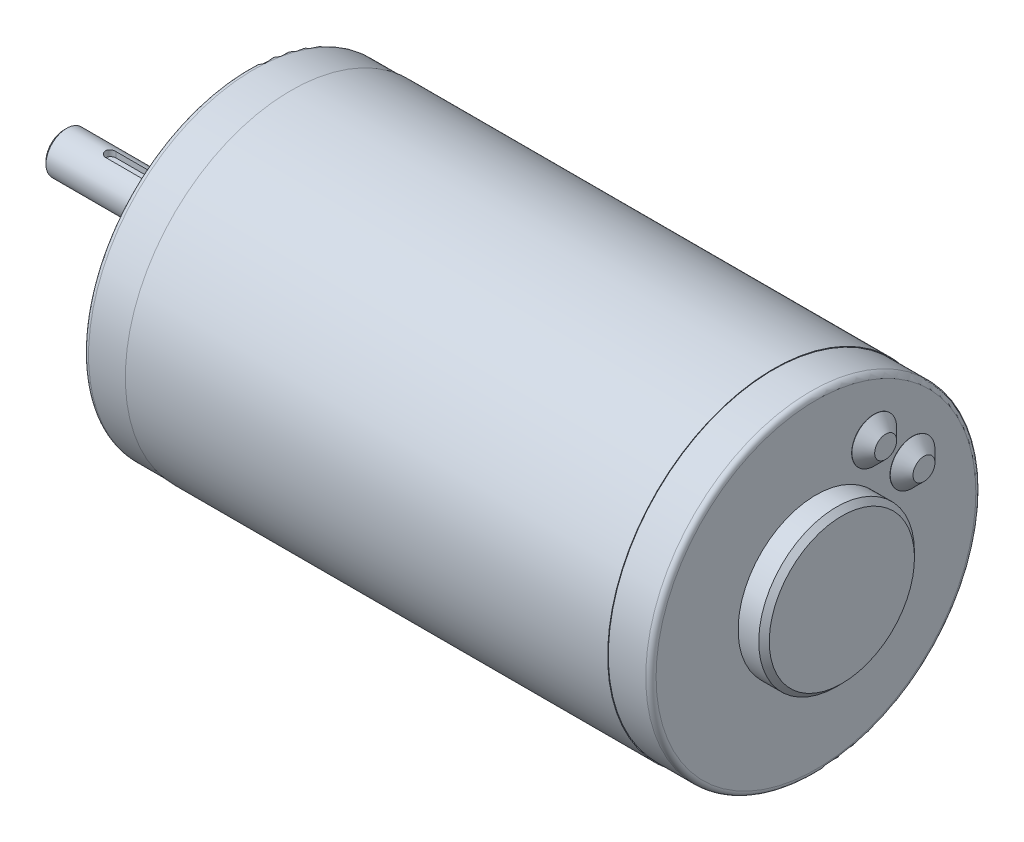
ISO-10303-21;
HEADER;
FILE_DESCRIPTION(('STEP AP214'),'2;1');
FILE_NAME('part.step','',(''),(''),'','','');
FILE_SCHEMA(('AUTOMOTIVE_DESIGN { 1 0 10303 214 1 1 1 1 }'));
ENDSEC;
DATA;
#1=APPLICATION_CONTEXT('core data for automotive mechanical design processes');
#2=APPLICATION_PROTOCOL_DEFINITION('international standard','automotive_design',2000,#1);
#3=PRODUCT_CONTEXT('',#1,'mechanical');
#4=PRODUCT('Part','Part','',(#3));
#5=PRODUCT_RELATED_PRODUCT_CATEGORY('part','',(#4));
#6=PRODUCT_DEFINITION_FORMATION('','',#4);
#7=PRODUCT_DEFINITION_CONTEXT('part definition',#1,'design');
#8=PRODUCT_DEFINITION('design','',#6,#7);
#9=PRODUCT_DEFINITION_SHAPE('','',#8);
#10=(LENGTH_UNIT() NAMED_UNIT(*) SI_UNIT(.MILLI.,.METRE.));
#11=(NAMED_UNIT(*) PLANE_ANGLE_UNIT() SI_UNIT($,.RADIAN.));
#12=(NAMED_UNIT(*) SI_UNIT($,.STERADIAN.) SOLID_ANGLE_UNIT());
#13=UNCERTAINTY_MEASURE_WITH_UNIT(LENGTH_MEASURE(1.E-05),#10,'distance_accuracy_value','');
#14=(GEOMETRIC_REPRESENTATION_CONTEXT(3) GLOBAL_UNCERTAINTY_ASSIGNED_CONTEXT((#13)) GLOBAL_UNIT_ASSIGNED_CONTEXT((#10,
#11,#12)) REPRESENTATION_CONTEXT('',''));
#15=CARTESIAN_POINT('',(0.,0.,0.));
#16=DIRECTION('',(0.,0.,1.));
#17=DIRECTION('',(1.,0.,0.));
#18=AXIS2_PLACEMENT_3D('',#15,#16,#17);
#19=CARTESIAN_POINT('',(-27.6,2.79999999999999,-1.));
#20=DIRECTION('',(0.,-1.,0.));
#21=DIRECTION('',(0.,0.,-1.));
#22=AXIS2_PLACEMENT_3D('',#19,#20,#21);
#23=PLANE('',#22);
#24=CARTESIAN_POINT('',(-7.1,2.79999999999999,0.));
#25=DIRECTION('',(0.,1.,0.));
#26=DIRECTION('',(0.,0.,1.));
#27=AXIS2_PLACEMENT_3D('',#24,#25,#26);
#28=CIRCLE('',#27,1.);
#29=CARTESIAN_POINT('',(-7.1,2.79999999999999,1.));
#30=VERTEX_POINT('',#29);
#31=CARTESIAN_POINT('',(-7.1,2.79999999999999,-1.));
#32=VERTEX_POINT('',#31);
#33=EDGE_CURVE('E79',#30,#32,#28,.T.);
#34=ORIENTED_EDGE('',*,*,#33,.T.);
#35=DIRECTION('',(1.,0.,0.));
#36=VECTOR('',#35,1.);
#37=CARTESIAN_POINT('',(-27.6,2.79999999999999,-1.));
#38=LINE('',#37,#36);
#39=CARTESIAN_POINT('',(-26.6,2.79999999999999,-1.));
#40=VERTEX_POINT('',#39);
#41=EDGE_CURVE('E74',#40,#32,#38,.T.);
#42=ORIENTED_EDGE('',*,*,#41,.F.);
#43=CARTESIAN_POINT('',(-26.6,2.79999999999999,0.));
#44=DIRECTION('',(0.,-1.,0.));
#45=DIRECTION('',(0.,0.,-1.));
#46=AXIS2_PLACEMENT_3D('',#43,#44,#45);
#47=CIRCLE('',#46,1.);
#48=CARTESIAN_POINT('',(-26.6,2.79999999999999,1.));
#49=VERTEX_POINT('',#48);
#50=EDGE_CURVE('E76',#40,#49,#47,.F.);
#51=ORIENTED_EDGE('',*,*,#50,.T.);
#52=DIRECTION('',(1.,0.,0.));
#53=VECTOR('',#52,1.);
#54=CARTESIAN_POINT('',(-27.6,2.79999999999999,1.));
#55=LINE('',#54,#53);
#56=EDGE_CURVE('E102',#49,#30,#55,.T.);
#57=ORIENTED_EDGE('',*,*,#56,.T.);
#58=EDGE_LOOP('',(#34,#42,#51,#57));
#59=FACE_BOUND('',#58,.T.);
#60=ADVANCED_FACE('F16',(#59),#23,.F.);
#61=CARTESIAN_POINT('',(-35.6,0.,0.));
#62=DIRECTION('',(-1.,0.,0.));
#63=DIRECTION('',(0.,0.,1.));
#64=AXIS2_PLACEMENT_3D('',#61,#62,#63);
#65=PLANE('',#64);
#66=CARTESIAN_POINT('',(-35.6000000000449,0.,0.));
#67=DIRECTION('',(1.,0.,0.));
#68=DIRECTION('',(0.,0.,-1.));
#69=AXIS2_PLACEMENT_3D('',#66,#67,#68);
#70=CIRCLE('',#69,3.49999999997408);
#71=CARTESIAN_POINT('',(-35.6000000000449,0.,-3.49999999997408));
#72=VERTEX_POINT('',#71);
#73=EDGE_CURVE('E324',#72,#72,#70,.T.);
#74=ORIENTED_EDGE('',*,*,#73,.F.);
#75=EDGE_LOOP('',(#74));
#76=FACE_BOUND('',#75,.T.);
#77=ADVANCED_FACE('F667',(#76),#65,.T.);
#78=CARTESIAN_POINT('',(-26.6,3.87298334620741,0.));
#79=DIRECTION('',(0.,-1.,0.));
#80=DIRECTION('',(0.,0.,-1.));
#81=AXIS2_PLACEMENT_3D('',#78,#79,#80);
#82=CYLINDRICAL_SURFACE('',#81,1.);
#83=CARTESIAN_POINT('',(-26.6,3.87298334620741,1.));
#84=CARTESIAN_POINT('',(-26.6276629851065,3.87298148580177,1.00000033749611));
#85=CARTESIAN_POINT('',(-26.6553122630182,3.8732800994947,0.998851407375366));
#86=CARTESIAN_POINT('',(-26.7104040353036,3.87445904774558,0.994271295395754));
#87=CARTESIAN_POINT('',(-26.7378465636871,3.87533928441687,0.99084049757268));
#88=CARTESIAN_POINT('',(-26.8194531732088,3.87881710972053,0.977175239382527));
#89=CARTESIAN_POINT('',(-26.8730564684822,3.88225203148808,0.963567695172493));
#90=CARTESIAN_POINT('',(-26.977124673782,3.89095422588002,0.927798076247996));
#91=CARTESIAN_POINT('',(-27.0275898782129,3.89622132630929,0.905636805423835));
#92=CARTESIAN_POINT('',(-27.1241114486473,3.90799134471939,0.853415378025865));
#93=CARTESIAN_POINT('',(-27.170166627891,3.91449459395647,0.823353103356933));
#94=CARTESIAN_POINT('',(-27.2575438819061,3.92816262398025,0.755484471828068));
#95=CARTESIAN_POINT('',(-27.2987548862455,3.93533791028915,0.717537268783974));
#96=CARTESIAN_POINT('',(-27.3743020894827,3.94945104396193,0.635275780516228));
#97=CARTESIAN_POINT('',(-27.4086371894679,3.95638885322537,0.590960479478829));
#98=CARTESIAN_POINT('',(-27.4699110016186,3.96936182283248,0.496456899401689));
#99=CARTESIAN_POINT('',(-27.496739895984,3.9753830468173,0.446195340334472));
#100=CARTESIAN_POINT('',(-27.5415247341967,3.98572346250588,0.341702590842916));
#101=CARTESIAN_POINT('',(-27.5594824242998,3.990042989147,0.287472184083007));
#102=CARTESIAN_POINT('',(-27.5856589927774,3.99641900005128,0.177744108525158));
#103=CARTESIAN_POINT('',(-27.5940676724228,3.998519529013,0.122294322002856));
#104=CARTESIAN_POINT('',(-27.6015033715433,4.00037438150815,0.0107327756816783));
#105=CARTESIAN_POINT('',(-27.6005315701923,4.00012899993444,-0.0453789000287066));
#106=CARTESIAN_POINT('',(-27.5893700363145,3.99735237365735,-0.155352492972097));
#107=CARTESIAN_POINT('',(-27.5793853834005,3.9948719867736,-0.209236701739855));
#108=CARTESIAN_POINT('',(-27.5508113208172,3.98796330636495,-0.31453871108434));
#109=CARTESIAN_POINT('',(-27.5322215304314,3.98353492665556,-0.365956402423988));
#110=CARTESIAN_POINT('',(-27.4867987193293,3.97314997761798,-0.46540728602454));
#111=CARTESIAN_POINT('',(-27.4598926057672,3.96717993827555,-0.513405629602248));
#112=CARTESIAN_POINT('',(-27.3986568701665,3.95435945541919,-0.604276631230015));
#113=CARTESIAN_POINT('',(-27.3643261297468,3.94750887933198,-0.64714851556229));
#114=CARTESIAN_POINT('',(-27.2881210879187,3.93345566022865,-0.727769389708492));
#115=CARTESIAN_POINT('',(-27.2460683634602,3.92624850477685,-0.765349103054128));
#116=CARTESIAN_POINT('',(-27.1561701330723,3.91246168284006,-0.832969575186237));
#117=CARTESIAN_POINT('',(-27.1083230467164,3.90588218842993,-0.863008270245062));
#118=CARTESIAN_POINT('',(-27.0078544021762,3.89407813586325,-0.914804709285962));
#119=CARTESIAN_POINT('',(-26.9552085351039,3.88886106009136,-0.936517017887269));
#120=CARTESIAN_POINT('',(-26.8468830715817,3.88047058807055,-0.970702351849828));
#121=CARTESIAN_POINT('',(-26.7912081448502,3.87729413761435,-0.983189189212132));
#122=CARTESIAN_POINT('',(-26.7125426192411,3.87455290681524,-0.993904635150938));
#123=CARTESIAN_POINT('',(-26.6900802967868,3.87396523110859,-0.996190790966708));
#124=CARTESIAN_POINT('',(-26.6450822100907,3.87318062488974,-0.999236757697394));
#125=CARTESIAN_POINT('',(-26.6225466240447,3.87298306219461,-0.999999038096045));
#126=CARTESIAN_POINT('',(-26.6,3.87298334620741,-1.));
#127=B_SPLINE_CURVE_WITH_KNOTS('',3,(#83,#84,#85,#86,#87,#88,#89,#90,#91,#92,#93,#94,#95,#96,
#97,#98,#99,#100,#101,#102,#103,#104,#105,#106,#107,#108,#109,#110,#111,#112,#113,#114,#115,
#116,#117,#118,#119,#120,#121,#122,#123,#124,#125,#126),.UNSPECIFIED.,.F.,.F.,(4,2,2,2,2,2,2,2,
2,2,2,2,2,2,2,2,2,2,2,2,2,4),(0.,0.0829365303397693,0.16585910608465,0.331229963080318,
0.496585282091499,0.661984974726751,0.830641897427977,0.999325753539196,1.17036187098235,
1.34136430732425,1.50890481515325,1.67642426256639,1.84022545479276,2.00403389475838,
2.16932509450376,2.33464120964329,2.50441429534542,2.67423379180967,2.84496720161068,
3.01544447539986,3.08315848722648,3.15076267731671),.UNSPECIFIED.);
#128=CARTESIAN_POINT('',(-26.6,3.87298334620741,1.));
#129=VERTEX_POINT('',#128);
#130=CARTESIAN_POINT('',(-26.6,3.87298334620741,-1.));
#131=VERTEX_POINT('',#130);
#132=EDGE_CURVE('E160',#129,#131,#127,.T.);
#133=ORIENTED_EDGE('',*,*,#132,.F.);
#134=DIRECTION('',(0.,1.,0.));
#135=VECTOR('',#134,1.);
#136=CARTESIAN_POINT('',(-26.6,2.79999999999999,1.));
#137=LINE('',#136,#135);
#138=EDGE_CURVE('E89',#129,#49,#137,.F.);
#139=ORIENTED_EDGE('',*,*,#138,.T.);
#140=ORIENTED_EDGE('',*,*,#50,.F.);
#141=DIRECTION('',(0.,1.,0.));
#142=VECTOR('',#141,1.);
#143=CARTESIAN_POINT('',(-26.6,2.79999999999999,-1.));
#144=LINE('',#143,#142);
#145=EDGE_CURVE('E83',#131,#40,#144,.F.);
#146=ORIENTED_EDGE('',*,*,#145,.F.);
#147=EDGE_LOOP('',(#133,#139,#140,#146));
#148=FACE_BOUND('',#147,.T.);
#149=ADVANCED_FACE('F86',(#148),#82,.F.);
#150=CARTESIAN_POINT('',(-27.6,2.79999999999999,-1.));
#151=DIRECTION('',(0.,0.,1.));
#152=DIRECTION('',(1.,0.,0.));
#153=AXIS2_PLACEMENT_3D('',#150,#151,#152);
#154=PLANE('',#153);
#155=DIRECTION('',(1.,0.,0.));
#156=VECTOR('',#155,1.);
#157=CARTESIAN_POINT('',(0.,3.87298334620741,-1.));
#158=LINE('',#157,#156);
#159=CARTESIAN_POINT('',(-7.1,3.87298334620741,-1.));
#160=VERTEX_POINT('',#159);
#161=EDGE_CURVE('E94',#131,#160,#158,.T.);
#162=ORIENTED_EDGE('',*,*,#161,.F.);
#163=ORIENTED_EDGE('',*,*,#145,.T.);
#164=ORIENTED_EDGE('',*,*,#41,.T.);
#165=DIRECTION('',(0.,1.,0.));
#166=VECTOR('',#165,1.);
#167=CARTESIAN_POINT('',(-7.1,2.79999999999999,-1.));
#168=LINE('',#167,#166);
#169=EDGE_CURVE('E97',#32,#160,#168,.T.);
#170=ORIENTED_EDGE('',*,*,#169,.T.);
#171=EDGE_LOOP('',(#162,#163,#164,#170));
#172=FACE_BOUND('',#171,.T.);
#173=ADVANCED_FACE('F92',(#172),#154,.T.);
#174=CARTESIAN_POINT('',(-7.1,2.79999999999999,0.));
#175=DIRECTION('',(0.,1.,0.));
#176=DIRECTION('',(0.,0.,1.));
#177=AXIS2_PLACEMENT_3D('',#174,#175,#176);
#178=CYLINDRICAL_SURFACE('',#177,1.);
#179=ORIENTED_EDGE('',*,*,#33,.F.);
#180=DIRECTION('',(0.,1.,0.));
#181=VECTOR('',#180,1.);
#182=CARTESIAN_POINT('',(-7.1,2.79999999999999,1.));
#183=LINE('',#182,#181);
#184=CARTESIAN_POINT('',(-7.1,3.87298334620741,1.));
#185=VERTEX_POINT('',#184);
#186=EDGE_CURVE('E103',#30,#185,#183,.T.);
#187=ORIENTED_EDGE('',*,*,#186,.T.);
#188=CARTESIAN_POINT('',(-7.1,3.87298334620741,-1.));
#189=CARTESIAN_POINT('',(-7.07233701489346,3.87298148580177,-1.00000033749611));
#190=CARTESIAN_POINT('',(-7.04468773698177,3.8732800994947,-0.998851407375366));
#191=CARTESIAN_POINT('',(-6.98959596469644,3.87445904774558,-0.994271295395754));
#192=CARTESIAN_POINT('',(-6.96215343631291,3.87533928441687,-0.990840497572679));
#193=CARTESIAN_POINT('',(-6.88054682679116,3.87881710972053,-0.977175239382527));
#194=CARTESIAN_POINT('',(-6.82694353151779,3.88225203148808,-0.963567695172494));
#195=CARTESIAN_POINT('',(-6.72287532621804,3.89095422588002,-0.927798076247997));
#196=CARTESIAN_POINT('',(-6.67241012178715,3.89622132630929,-0.905636805423836));
#197=CARTESIAN_POINT('',(-6.57588855135267,3.90799134471939,-0.853415378025865));
#198=CARTESIAN_POINT('',(-6.52983337210904,3.91449459395647,-0.823353103356933));
#199=CARTESIAN_POINT('',(-6.4424561180939,3.92816262398025,-0.755484471828069));
#200=CARTESIAN_POINT('',(-6.40124511375448,3.93533791028915,-0.717537268783976));
#201=CARTESIAN_POINT('',(-6.3256979105173,3.94945104396193,-0.63527578051623));
#202=CARTESIAN_POINT('',(-6.29136281053206,3.95638885322537,-0.590960479478831));
#203=CARTESIAN_POINT('',(-6.23008899838136,3.96936182283248,-0.496456899401691));
#204=CARTESIAN_POINT('',(-6.20326010401603,3.9753830468173,-0.446195340334474));
#205=CARTESIAN_POINT('',(-6.1584752658033,3.98572346250588,-0.341702590842919));
#206=CARTESIAN_POINT('',(-6.14051757570017,3.990042989147,-0.28747218408301));
#207=CARTESIAN_POINT('',(-6.11434100722257,3.99641900005128,-0.17774410852516));
#208=CARTESIAN_POINT('',(-6.10593232757718,3.998519529013,-0.122294322002858));
#209=CARTESIAN_POINT('',(-6.09849662845671,4.00037438150815,-0.0107327756816796));
#210=CARTESIAN_POINT('',(-6.09946842980766,4.00012899993444,0.0453789000287056));
#211=CARTESIAN_POINT('',(-6.11062996368545,3.99735237365735,0.155352492972096));
#212=CARTESIAN_POINT('',(-6.12061461659948,3.9948719867736,0.209236701739855));
#213=CARTESIAN_POINT('',(-6.14918867918275,3.98796330636495,0.31453871108434));
#214=CARTESIAN_POINT('',(-6.16777846956858,3.98353492665556,0.365956402423988));
#215=CARTESIAN_POINT('',(-6.21320128067065,3.97314997761798,0.465407286024539));
#216=CARTESIAN_POINT('',(-6.24010739423284,3.96717993827555,0.513405629602249));
#217=CARTESIAN_POINT('',(-6.30134312983347,3.95435945541919,0.604276631230014));
#218=CARTESIAN_POINT('',(-6.33567387025322,3.94750887933198,0.647148515562289));
#219=CARTESIAN_POINT('',(-6.41187891208131,3.93345566022865,0.72776938970849));
#220=CARTESIAN_POINT('',(-6.45393163653982,3.92624850477685,0.765349103054127));
#221=CARTESIAN_POINT('',(-6.54382986692774,3.91246168284006,0.832969575186237));
#222=CARTESIAN_POINT('',(-6.59167695328356,3.90588218842993,0.863008270245062));
#223=CARTESIAN_POINT('',(-6.69214559782377,3.89407813586325,0.914804709285962));
#224=CARTESIAN_POINT('',(-6.74479146489609,3.88886106009136,0.936517017887269));
#225=CARTESIAN_POINT('',(-6.85311692841829,3.88047058807055,0.970702351849828));
#226=CARTESIAN_POINT('',(-6.90879185514984,3.87729413761435,0.983189189212131));
#227=CARTESIAN_POINT('',(-6.98745738075891,3.87455290681524,0.993904635150938));
#228=CARTESIAN_POINT('',(-7.00991970321318,3.87396523110859,0.996190790966708));
#229=CARTESIAN_POINT('',(-7.05491778990932,3.87318062488974,0.999236757697394));
#230=CARTESIAN_POINT('',(-7.07745337595529,3.8729830621946,0.999999038096045));
#231=CARTESIAN_POINT('',(-7.1,3.87298334620741,1.));
#232=B_SPLINE_CURVE_WITH_KNOTS('',3,(#188,#189,#190,#191,#192,#193,#194,#195,#196,#197,#198,
#199,#200,#201,#202,#203,#204,#205,#206,#207,#208,#209,#210,#211,#212,#213,#214,#215,#216,#217,
#218,#219,#220,#221,#222,#223,#224,#225,#226,#227,#228,#229,#230,#231),.UNSPECIFIED.,.F.,.F.,(4,
2,2,2,2,2,2,2,2,2,2,2,2,2,2,2,2,2,2,2,2,4),(0.,0.0829365303397684,0.165859106084651,
0.331229963080317,0.496585282091498,0.661984974726749,0.830641897427974,0.999325753539193,
1.17036187098235,1.34136430732424,1.50890481515325,1.67642426256639,1.84022545479276,
2.00403389475838,2.16932509450376,2.33464120964329,2.50441429534542,2.67423379180967,
2.84496720161068,3.01544447539986,3.08315848722648,3.15076267731671),.UNSPECIFIED.);
#233=EDGE_CURVE('E151',#160,#185,#232,.T.);
#234=ORIENTED_EDGE('',*,*,#233,.F.);
#235=ORIENTED_EDGE('',*,*,#169,.F.);
#236=EDGE_LOOP('',(#179,#187,#234,#235));
#237=FACE_BOUND('',#236,.T.);
#238=ADVANCED_FACE('F166',(#237),#178,.F.);
#239=CARTESIAN_POINT('',(-27.6,2.79999999999999,1.));
#240=DIRECTION('',(0.,0.,1.));
#241=DIRECTION('',(1.,0.,0.));
#242=AXIS2_PLACEMENT_3D('',#239,#240,#241);
#243=PLANE('',#242);
#244=ORIENTED_EDGE('',*,*,#186,.F.);
#245=ORIENTED_EDGE('',*,*,#56,.F.);
#246=ORIENTED_EDGE('',*,*,#138,.F.);
#247=DIRECTION('',(1.,0.,0.));
#248=VECTOR('',#247,1.);
#249=CARTESIAN_POINT('',(0.,3.87298334620741,1.));
#250=LINE('',#249,#248);
#251=EDGE_CURVE('E159',#185,#129,#250,.F.);
#252=ORIENTED_EDGE('',*,*,#251,.F.);
#253=EDGE_LOOP('',(#244,#245,#246,#252));
#254=FACE_BOUND('',#253,.T.);
#255=ADVANCED_FACE('F181',(#254),#243,.F.);
#256=CARTESIAN_POINT('',(-35.0999999999999,0.,0.));
#257=DIRECTION('',(1.,0.,0.));
#258=DIRECTION('',(0.,0.,-1.));
#259=AXIS2_PLACEMENT_3D('',#256,#257,#258);
#260=CONICAL_SURFACE('',#259,3.99999999996226,0.785398163340605);
#261=ORIENTED_EDGE('',*,*,#73,.T.);
#262=EDGE_LOOP('',(#261));
#263=FACE_BOUND('',#262,.T.);
#264=CARTESIAN_POINT('',(-35.1,0.,0.));
#265=DIRECTION('',(1.,0.,0.));
#266=DIRECTION('',(0.,0.,-1.));
#267=AXIS2_PLACEMENT_3D('',#264,#265,#266);
#268=CIRCLE('',#267,4.);
#269=CARTESIAN_POINT('',(-35.1,0.,-4.));
#270=VERTEX_POINT('',#269);
#271=EDGE_CURVE('E150',#270,#270,#268,.T.);
#272=ORIENTED_EDGE('',*,*,#271,.F.);
#273=EDGE_LOOP('',(#272));
#274=FACE_BOUND('',#273,.T.);
#275=ADVANCED_FACE('F176',(#263,#274),#260,.T.);
#276=CARTESIAN_POINT('',(0.,0.,0.));
#277=DIRECTION('',(1.,0.,0.));
#278=DIRECTION('',(0.,0.,-1.));
#279=AXIS2_PLACEMENT_3D('',#276,#277,#278);
#280=CYLINDRICAL_SURFACE('',#279,4.);
#281=ORIENTED_EDGE('',*,*,#271,.T.);
#282=EDGE_LOOP('',(#281));
#283=FACE_BOUND('',#282,.T.);
#284=CARTESIAN_POINT('',(-4.,0.,0.));
#285=DIRECTION('',(1.,0.,0.));
#286=DIRECTION('',(0.,0.,-1.));
#287=AXIS2_PLACEMENT_3D('',#284,#285,#286);
#288=CIRCLE('',#287,4.);
#289=CARTESIAN_POINT('',(-4.,0.,-4.));
#290=VERTEX_POINT('',#289);
#291=EDGE_CURVE('E147',#290,#290,#288,.T.);
#292=ORIENTED_EDGE('',*,*,#291,.F.);
#293=EDGE_LOOP('',(#292));
#294=FACE_BOUND('',#293,.T.);
#295=ORIENTED_EDGE('',*,*,#233,.T.);
#296=ORIENTED_EDGE('',*,*,#251,.T.);
#297=ORIENTED_EDGE('',*,*,#132,.T.);
#298=ORIENTED_EDGE('',*,*,#161,.T.);
#299=EDGE_LOOP('',(#295,#296,#297,#298));
#300=FACE_BOUND('',#299,.T.);
#301=ADVANCED_FACE('F170',(#283,#294,#300),#280,.T.);
#302=CARTESIAN_POINT('',(-4.,4.,0.));
#303=DIRECTION('',(-1.,0.,0.));
#304=DIRECTION('',(0.,0.,1.));
#305=AXIS2_PLACEMENT_3D('',#302,#303,#304);
#306=PLANE('',#305);
#307=ORIENTED_EDGE('',*,*,#291,.T.);
#308=EDGE_LOOP('',(#307));
#309=FACE_BOUND('',#308,.T.);
#310=CARTESIAN_POINT('',(-4.,0.,0.));
#311=DIRECTION('',(1.,0.,0.));
#312=DIRECTION('',(0.,1.,0.));
#313=AXIS2_PLACEMENT_3D('',#310,#311,#312);
#314=CIRCLE('',#313,8.509);
#315=CARTESIAN_POINT('',(-4.,8.509,0.));
#316=VERTEX_POINT('',#315);
#317=EDGE_CURVE('E144',#316,#316,#314,.T.);
#318=ORIENTED_EDGE('',*,*,#317,.F.);
#319=EDGE_LOOP('',(#318));
#320=FACE_BOUND('',#319,.T.);
#321=ADVANCED_FACE('F175',(#309,#320),#306,.T.);
#322=CARTESIAN_POINT('',(111.8479,18.6070906828553,-11.2073596390943));
#323=DIRECTION('',(1.,0.,0.));
#324=DIRECTION('',(0.,0.,-1.));
#325=AXIS2_PLACEMENT_3D('',#322,#323,#324);
#326=PLANE('',#325);
#327=CARTESIAN_POINT('',(111.84789999993,18.6070906828553,-11.2073596390943));
#328=DIRECTION('',(-1.,0.,0.));
#329=DIRECTION('',(0.,-1.,0.));
#330=AXIS2_PLACEMENT_3D('',#327,#328,#329);
#331=CIRCLE('',#330,2.11800000003146);
#332=CARTESIAN_POINT('',(111.84789999993,16.4890906828238,-11.2073596390943));
#333=VERTEX_POINT('',#332);
#334=EDGE_CURVE('E141',#333,#333,#331,.T.);
#335=ORIENTED_EDGE('',*,*,#334,.F.);
#336=EDGE_LOOP('',(#335));
#337=FACE_BOUND('',#336,.T.);
#338=ADVANCED_FACE('F484',(#337),#326,.T.);
#339=CARTESIAN_POINT('',(114.6,15.0368,0.));
#340=DIRECTION('',(1.,0.,0.));
#341=DIRECTION('',(0.,0.,-1.));
#342=AXIS2_PLACEMENT_3D('',#339,#340,#341);
#343=PLANE('',#342);
#344=CARTESIAN_POINT('',(114.6,0.,0.));
#345=DIRECTION('',(-1.,0.,0.));
#346=DIRECTION('',(0.,-1.,0.));
#347=AXIS2_PLACEMENT_3D('',#344,#345,#346);
#348=CIRCLE('',#347,14.0208);
#349=CARTESIAN_POINT('',(114.6,-14.0208,0.));
#350=VERTEX_POINT('',#349);
#351=EDGE_CURVE('E138',#350,#350,#348,.T.);
#352=ORIENTED_EDGE('',*,*,#351,.F.);
#353=EDGE_LOOP('',(#352));
#354=FACE_BOUND('',#353,.T.);
#355=ADVANCED_FACE('F474',(#354),#343,.T.);
#356=CARTESIAN_POINT('',(111.8479,11.2073596390943,-18.6070906828553));
#357=DIRECTION('',(1.,0.,0.));
#358=DIRECTION('',(0.,0.,-1.));
#359=AXIS2_PLACEMENT_3D('',#356,#357,#358);
#360=PLANE('',#359);
#361=CARTESIAN_POINT('',(111.84789999993,11.2073596390943,-18.6070906828553));
#362=DIRECTION('',(-1.,0.,0.));
#363=DIRECTION('',(0.,0.,1.));
#364=AXIS2_PLACEMENT_3D('',#361,#362,#363);
#365=CIRCLE('',#364,2.1180000000021);
#366=CARTESIAN_POINT('',(111.84789999993,11.2073596390943,-16.4890906828532));
#367=VERTEX_POINT('',#366);
#368=EDGE_CURVE('E134',#367,#367,#365,.T.);
#369=ORIENTED_EDGE('',*,*,#368,.F.);
#370=EDGE_LOOP('',(#369));
#371=FACE_BOUND('',#370,.T.);
#372=ADVANCED_FACE('F467',(#371),#360,.T.);
#373=CARTESIAN_POINT('',(13.6143999999945,25.4,0.));
#374=DIRECTION('',(-1.,0.,0.));
#375=DIRECTION('',(0.,0.,1.));
#376=AXIS2_PLACEMENT_3D('',#373,#374,#375);
#377=CONICAL_SURFACE('',#376,2.01929999997219,1.02974425867198);
#378=CARTESIAN_POINT('',(14.827717847993,25.4,0.));
#379=VERTEX_POINT('',#378);
#380=VERTEX_LOOP('',#379);
#381=FACE_BOUND('',#380,.T.);
#382=CARTESIAN_POINT('',(13.6144,25.4,0.));
#383=DIRECTION('',(-1.,0.,0.));
#384=DIRECTION('',(0.,0.,1.));
#385=AXIS2_PLACEMENT_3D('',#382,#383,#384);
#386=CIRCLE('',#385,2.0193);
#387=CARTESIAN_POINT('',(13.6144,25.4,2.0193));
#388=VERTEX_POINT('',#387);
#389=EDGE_CURVE('E137',#388,#388,#386,.T.);
#390=ORIENTED_EDGE('',*,*,#389,.T.);
#391=EDGE_LOOP('',(#390));
#392=FACE_BOUND('',#391,.T.);
#393=ADVANCED_FACE('F473',(#381,#392),#377,.F.);
#394=CARTESIAN_POINT('',(13.6143999999945,-25.4,0.));
#395=DIRECTION('',(-1.,0.,0.));
#396=DIRECTION('',(0.,0.,1.));
#397=AXIS2_PLACEMENT_3D('',#394,#395,#396);
#398=CONICAL_SURFACE('',#397,2.01929999997219,1.02974425867198);
#399=CARTESIAN_POINT('',(14.827717847993,-25.4,0.));
#400=VERTEX_POINT('',#399);
#401=VERTEX_LOOP('',#400);
#402=FACE_BOUND('',#401,.T.);
#403=CARTESIAN_POINT('',(13.6144,-25.4,0.));
#404=DIRECTION('',(-1.,0.,0.));
#405=DIRECTION('',(0.,0.,1.));
#406=AXIS2_PLACEMENT_3D('',#403,#404,#405);
#407=CIRCLE('',#406,2.0193);
#408=CARTESIAN_POINT('',(13.6144,-25.4,2.0193));
#409=VERTEX_POINT('',#408);
#410=EDGE_CURVE('E314',#409,#409,#407,.T.);
#411=ORIENTED_EDGE('',*,*,#410,.T.);
#412=EDGE_LOOP('',(#411));
#413=FACE_BOUND('',#412,.T.);
#414=ADVANCED_FACE('F535',(#402,#413),#398,.F.);
#415=CARTESIAN_POINT('',(-2.984,0.,0.));
#416=DIRECTION('',(1.,0.,0.));
#417=DIRECTION('',(0.,1.,0.));
#418=AXIS2_PLACEMENT_3D('',#415,#416,#417);
#419=CONICAL_SURFACE('',#418,9.525,0.78539816339745);
#420=ORIENTED_EDGE('',*,*,#317,.T.);
#421=EDGE_LOOP('',(#420));
#422=FACE_BOUND('',#421,.T.);
#423=CARTESIAN_POINT('',(-2.984,0.,0.));
#424=DIRECTION('',(1.,0.,0.));
#425=DIRECTION('',(0.,0.,-1.));
#426=AXIS2_PLACEMENT_3D('',#423,#424,#425);
#427=CIRCLE('',#426,9.525);
#428=CARTESIAN_POINT('',(-2.984,0.,-9.525));
#429=VERTEX_POINT('',#428);
#430=EDGE_CURVE('E311',#429,#429,#427,.T.);
#431=ORIENTED_EDGE('',*,*,#430,.F.);
#432=EDGE_LOOP('',(#431));
#433=FACE_BOUND('',#432,.T.);
#434=ADVANCED_FACE('F459',(#422,#433),#419,.T.);
#435=CARTESIAN_POINT('',(109.647900000027,18.6070906828553,-11.2073596390943));
#436=DIRECTION('',(-1.,0.,0.));
#437=DIRECTION('',(0.,-1.,0.));
#438=AXIS2_PLACEMENT_3D('',#435,#436,#437);
#439=CONICAL_SURFACE('',#438,4.31799999987712,0.785398163384529);
#440=CARTESIAN_POINT('',(109.6479,18.6070906828553,-11.2073596390943));
#441=DIRECTION('',(-1.,0.,0.));
#442=DIRECTION('',(0.,0.,1.));
#443=AXIS2_PLACEMENT_3D('',#440,#441,#442);
#444=CIRCLE('',#443,4.318);
#445=CARTESIAN_POINT('',(109.6479,18.6070906828553,-6.88935963909434));
#446=VERTEX_POINT('',#445);
#447=EDGE_CURVE('E308',#446,#446,#444,.T.);
#448=ORIENTED_EDGE('',*,*,#447,.F.);
#449=EDGE_LOOP('',(#448));
#450=FACE_BOUND('',#449,.T.);
#451=ORIENTED_EDGE('',*,*,#334,.T.);
#452=EDGE_LOOP('',(#451));
#453=FACE_BOUND('',#452,.T.);
#454=ADVANCED_FACE('F453',(#450,#453),#439,.T.);
#455=CARTESIAN_POINT('',(113.584,0.,0.));
#456=DIRECTION('',(-1.,0.,0.));
#457=DIRECTION('',(0.,-1.,0.));
#458=AXIS2_PLACEMENT_3D('',#455,#456,#457);
#459=CONICAL_SURFACE('',#458,15.0368,0.785398163397441);
#460=ORIENTED_EDGE('',*,*,#351,.T.);
#461=EDGE_LOOP('',(#460));
#462=FACE_BOUND('',#461,.T.);
#463=CARTESIAN_POINT('',(113.584,0.,0.));
#464=DIRECTION('',(1.,0.,0.));
#465=DIRECTION('',(0.,0.,-1.));
#466=AXIS2_PLACEMENT_3D('',#463,#464,#465);
#467=CIRCLE('',#466,15.0368);
#468=CARTESIAN_POINT('',(113.584,0.,-15.0368));
#469=VERTEX_POINT('',#468);
#470=EDGE_CURVE('E305',#469,#469,#467,.F.);
#471=ORIENTED_EDGE('',*,*,#470,.F.);
#472=EDGE_LOOP('',(#471));
#473=FACE_BOUND('',#472,.T.);
#474=ADVANCED_FACE('F445',(#462,#473),#459,.T.);
#475=CARTESIAN_POINT('',(109.647900000084,11.2073596390943,-18.6070906828553));
#476=DIRECTION('',(-1.,0.,0.));
#477=DIRECTION('',(0.,0.,1.));
#478=AXIS2_PLACEMENT_3D('',#475,#476,#477);
#479=CONICAL_SURFACE('',#478,4.31799999990461,0.785398163410367);
#480=CARTESIAN_POINT('',(109.6479,11.2073596390943,-18.6070906828553));
#481=DIRECTION('',(-1.,0.,0.));
#482=DIRECTION('',(0.,0.,1.));
#483=AXIS2_PLACEMENT_3D('',#480,#481,#482);
#484=CIRCLE('',#483,4.318);
#485=CARTESIAN_POINT('',(109.6479,11.2073596390943,-14.2890906828553));
#486=VERTEX_POINT('',#485);
#487=EDGE_CURVE('E133',#486,#486,#484,.T.);
#488=ORIENTED_EDGE('',*,*,#487,.F.);
#489=EDGE_LOOP('',(#488));
#490=FACE_BOUND('',#489,.T.);
#491=ORIENTED_EDGE('',*,*,#368,.T.);
#492=EDGE_LOOP('',(#491));
#493=FACE_BOUND('',#492,.T.);
#494=ADVANCED_FACE('F434',(#490,#493),#479,.T.);
#495=CARTESIAN_POINT('',(0.,25.4,0.));
#496=DIRECTION('',(-1.,0.,0.));
#497=DIRECTION('',(0.,0.,1.));
#498=AXIS2_PLACEMENT_3D('',#495,#496,#497);
#499=CYLINDRICAL_SURFACE('',#498,2.0193);
#500=CARTESIAN_POINT('',(0.,25.4,0.));
#501=DIRECTION('',(-1.,0.,0.));
#502=DIRECTION('',(0.,0.,1.));
#503=AXIS2_PLACEMENT_3D('',#500,#501,#502);
#504=CIRCLE('',#503,2.0193);
#505=CARTESIAN_POINT('',(0.,25.4,2.0193));
#506=VERTEX_POINT('',#505);
#507=EDGE_CURVE('E130',#506,#506,#504,.F.);
#508=ORIENTED_EDGE('',*,*,#507,.F.);
#509=EDGE_LOOP('',(#508));
#510=FACE_BOUND('',#509,.T.);
#511=ORIENTED_EDGE('',*,*,#389,.F.);
#512=EDGE_LOOP('',(#511));
#513=FACE_BOUND('',#512,.T.);
#514=ADVANCED_FACE('F423',(#510,#513),#499,.F.);
#515=CARTESIAN_POINT('',(0.,-25.4,0.));
#516=DIRECTION('',(-1.,0.,0.));
#517=DIRECTION('',(0.,0.,1.));
#518=AXIS2_PLACEMENT_3D('',#515,#516,#517);
#519=CYLINDRICAL_SURFACE('',#518,2.0193);
#520=CARTESIAN_POINT('',(0.,-25.4,0.));
#521=DIRECTION('',(-1.,0.,0.));
#522=DIRECTION('',(0.,0.,1.));
#523=AXIS2_PLACEMENT_3D('',#520,#521,#522);
#524=CIRCLE('',#523,2.0193);
#525=CARTESIAN_POINT('',(0.,-25.4,2.0193));
#526=VERTEX_POINT('',#525);
#527=EDGE_CURVE('E127',#526,#526,#524,.F.);
#528=ORIENTED_EDGE('',*,*,#527,.F.);
#529=EDGE_LOOP('',(#528));
#530=FACE_BOUND('',#529,.T.);
#531=ORIENTED_EDGE('',*,*,#410,.F.);
#532=EDGE_LOOP('',(#531));
#533=FACE_BOUND('',#532,.T.);
#534=ADVANCED_FACE('F417',(#530,#533),#519,.F.);
#535=CARTESIAN_POINT('',(0.,0.,0.));
#536=DIRECTION('',(1.,0.,0.));
#537=DIRECTION('',(0.,0.,-1.));
#538=AXIS2_PLACEMENT_3D('',#535,#536,#537);
#539=CYLINDRICAL_SURFACE('',#538,9.525);
#540=ORIENTED_EDGE('',*,*,#430,.T.);
#541=EDGE_LOOP('',(#540));
#542=FACE_BOUND('',#541,.T.);
#543=CARTESIAN_POINT('',(0.,0.,0.));
#544=DIRECTION('',(1.,0.,0.));
#545=DIRECTION('',(0.,0.,-1.));
#546=AXIS2_PLACEMENT_3D('',#543,#544,#545);
#547=CIRCLE('',#546,9.525);
#548=CARTESIAN_POINT('',(0.,0.,-9.525));
#549=VERTEX_POINT('',#548);
#550=EDGE_CURVE('E124',#549,#549,#547,.T.);
#551=ORIENTED_EDGE('',*,*,#550,.F.);
#552=EDGE_LOOP('',(#551));
#553=FACE_BOUND('',#552,.T.);
#554=ADVANCED_FACE('F409',(#542,#553),#539,.T.);
#555=CARTESIAN_POINT('',(111.8479,18.6070906828553,-11.2073596390943));
#556=DIRECTION('',(-1.,0.,0.));
#557=DIRECTION('',(0.,0.,1.));
#558=AXIS2_PLACEMENT_3D('',#555,#556,#557);
#559=CYLINDRICAL_SURFACE('',#558,4.318);
#560=CARTESIAN_POINT('',(109.6,18.6070906828553,-11.2073596390943));
#561=DIRECTION('',(-1.,0.,0.));
#562=DIRECTION('',(0.,0.,1.));
#563=AXIS2_PLACEMENT_3D('',#560,#561,#562);
#564=CIRCLE('',#563,4.318);
#565=CARTESIAN_POINT('',(109.6,18.6070906828553,-6.88935963909434));
#566=VERTEX_POINT('',#565);
#567=EDGE_CURVE('E121',#566,#566,#564,.T.);
#568=ORIENTED_EDGE('',*,*,#567,.F.);
#569=EDGE_LOOP('',(#568));
#570=FACE_BOUND('',#569,.T.);
#571=ORIENTED_EDGE('',*,*,#447,.T.);
#572=EDGE_LOOP('',(#571));
#573=FACE_BOUND('',#572,.T.);
#574=ADVANCED_FACE('F403',(#570,#573),#559,.T.);
#575=CARTESIAN_POINT('',(0.,0.,0.));
#576=DIRECTION('',(1.,0.,0.));
#577=DIRECTION('',(0.,0.,-1.));
#578=AXIS2_PLACEMENT_3D('',#575,#576,#577);
#579=CYLINDRICAL_SURFACE('',#578,15.0368);
#580=CARTESIAN_POINT('',(109.6,0.,0.));
#581=DIRECTION('',(1.,0.,0.));
#582=DIRECTION('',(0.,0.,-1.));
#583=AXIS2_PLACEMENT_3D('',#580,#581,#582);
#584=CIRCLE('',#583,15.0368);
#585=CARTESIAN_POINT('',(109.6,0.,-15.0368));
#586=VERTEX_POINT('',#585);
#587=EDGE_CURVE('E118',#586,#586,#584,.F.);
#588=ORIENTED_EDGE('',*,*,#587,.F.);
#589=EDGE_LOOP('',(#588));
#590=FACE_BOUND('',#589,.T.);
#591=ORIENTED_EDGE('',*,*,#470,.T.);
#592=EDGE_LOOP('',(#591));
#593=FACE_BOUND('',#592,.T.);
#594=ADVANCED_FACE('F394',(#590,#593),#579,.T.);
#595=CARTESIAN_POINT('',(111.8479,11.2073596390943,-18.6070906828553));
#596=DIRECTION('',(-1.,0.,0.));
#597=DIRECTION('',(0.,0.,1.));
#598=AXIS2_PLACEMENT_3D('',#595,#596,#597);
#599=CYLINDRICAL_SURFACE('',#598,4.318);
#600=CARTESIAN_POINT('',(109.6,11.2073596390943,-18.6070906828553));
#601=DIRECTION('',(-1.,0.,0.));
#602=DIRECTION('',(0.,0.,1.));
#603=AXIS2_PLACEMENT_3D('',#600,#601,#602);
#604=CIRCLE('',#603,4.318);
#605=CARTESIAN_POINT('',(109.6,11.2073596390943,-14.2890906828553));
#606=VERTEX_POINT('',#605);
#607=EDGE_CURVE('E114',#606,#606,#604,.T.);
#608=ORIENTED_EDGE('',*,*,#607,.F.);
#609=EDGE_LOOP('',(#608));
#610=FACE_BOUND('',#609,.T.);
#611=ORIENTED_EDGE('',*,*,#487,.T.);
#612=EDGE_LOOP('',(#611));
#613=FACE_BOUND('',#612,.T.);
#614=ADVANCED_FACE('F388',(#610,#613),#599,.T.);
#615=CARTESIAN_POINT('',(0.,9.525,0.));
#616=DIRECTION('',(-1.,0.,0.));
#617=DIRECTION('',(0.,0.,1.));
#618=AXIS2_PLACEMENT_3D('',#615,#616,#617);
#619=PLANE('',#618);
#620=ORIENTED_EDGE('',*,*,#550,.T.);
#621=EDGE_LOOP('',(#620));
#622=FACE_BOUND('',#621,.T.);
#623=CARTESIAN_POINT('',(0.,0.,0.));
#624=DIRECTION('',(1.,0.,0.));
#625=DIRECTION('',(0.,0.,-1.));
#626=AXIS2_PLACEMENT_3D('',#623,#624,#625);
#627=CIRCLE('',#626,30.877);
#628=CARTESIAN_POINT('',(0.,0.,-30.877));
#629=VERTEX_POINT('',#628);
#630=CARTESIAN_POINT('',(0.,0.,30.877));
#631=VERTEX_POINT('',#630);
#632=EDGE_CURVE('E117',#629,#631,#627,.T.);
#633=ORIENTED_EDGE('',*,*,#632,.F.);
#634=CARTESIAN_POINT('',(0.,0.,0.));
#635=DIRECTION('',(1.,0.,0.));
#636=DIRECTION('',(0.,0.,1.));
#637=AXIS2_PLACEMENT_3D('',#634,#635,#636);
#638=CIRCLE('',#637,30.877);
#639=EDGE_CURVE('E284',#631,#629,#638,.T.);
#640=ORIENTED_EDGE('',*,*,#639,.F.);
#641=EDGE_LOOP('',(#633,#640));
#642=FACE_BOUND('',#641,.T.);
#643=ORIENTED_EDGE('',*,*,#527,.T.);
#644=EDGE_LOOP('',(#643));
#645=FACE_BOUND('',#644,.T.);
#646=ORIENTED_EDGE('',*,*,#507,.T.);
#647=EDGE_LOOP('',(#646));
#648=FACE_BOUND('',#647,.T.);
#649=ADVANCED_FACE('F250',(#622,#642,#645,#648),#619,.T.);
#650=CARTESIAN_POINT('',(109.6,31.877,0.));
#651=DIRECTION('',(1.,0.,0.));
#652=DIRECTION('',(0.,0.,-1.));
#653=AXIS2_PLACEMENT_3D('',#650,#651,#652);
#654=PLANE('',#653);
#655=ORIENTED_EDGE('',*,*,#607,.T.);
#656=EDGE_LOOP('',(#655));
#657=FACE_BOUND('',#656,.T.);
#658=ORIENTED_EDGE('',*,*,#587,.T.);
#659=EDGE_LOOP('',(#658));
#660=FACE_BOUND('',#659,.T.);
#661=CARTESIAN_POINT('',(109.6,0.,0.));
#662=DIRECTION('',(-1.,0.,0.));
#663=DIRECTION('',(0.,0.,1.));
#664=AXIS2_PLACEMENT_3D('',#661,#662,#663);
#665=CIRCLE('',#664,30.877);
#666=CARTESIAN_POINT('',(109.6,0.,30.877));
#667=VERTEX_POINT('',#666);
#668=CARTESIAN_POINT('',(109.6,0.,-30.877));
#669=VERTEX_POINT('',#668);
#670=EDGE_CURVE('E35',#667,#669,#665,.T.);
#671=ORIENTED_EDGE('',*,*,#670,.F.);
#672=CARTESIAN_POINT('',(109.6,0.,0.));
#673=DIRECTION('',(-1.,0.,0.));
#674=DIRECTION('',(0.,0.,-1.));
#675=AXIS2_PLACEMENT_3D('',#672,#673,#674);
#676=CIRCLE('',#675,30.877);
#677=EDGE_CURVE('E232',#669,#667,#676,.T.);
#678=ORIENTED_EDGE('',*,*,#677,.F.);
#679=EDGE_LOOP('',(#671,#678));
#680=FACE_BOUND('',#679,.T.);
#681=ORIENTED_EDGE('',*,*,#567,.T.);
#682=EDGE_LOOP('',(#681));
#683=FACE_BOUND('',#682,.T.);
#684=ADVANCED_FACE('F241',(#657,#660,#680,#683),#654,.T.);
#685=CARTESIAN_POINT('',(0.999999999999999,0.,0.));
#686=DIRECTION('',(-1.,0.,0.));
#687=DIRECTION('',(0.,0.,1.));
#688=AXIS2_PLACEMENT_3D('',#685,#686,#687);
#689=TOROIDAL_SURFACE('',#688,30.877,1.);
#690=CARTESIAN_POINT('',(0.999999999999999,0.,0.));
#691=DIRECTION('',(1.,0.,0.));
#692=DIRECTION('',(0.,0.,-1.));
#693=AXIS2_PLACEMENT_3D('',#690,#691,#692);
#694=CIRCLE('',#693,31.877);
#695=CARTESIAN_POINT('',(0.999999999999999,0.,-31.877));
#696=VERTEX_POINT('',#695);
#697=EDGE_CURVE('E230',#696,#696,#694,.T.);
#698=ORIENTED_EDGE('',*,*,#697,.F.);
#699=EDGE_LOOP('',(#698));
#700=FACE_BOUND('',#699,.T.);
#701=ORIENTED_EDGE('',*,*,#639,.T.);
#702=ORIENTED_EDGE('',*,*,#632,.T.);
#703=EDGE_LOOP('',(#701,#702));
#704=FACE_BOUND('',#703,.T.);
#705=ADVANCED_FACE('F219',(#700,#704),#689,.T.);
#706=CARTESIAN_POINT('',(108.6,0.,0.));
#707=DIRECTION('',(1.,0.,0.));
#708=DIRECTION('',(0.,0.,-1.));
#709=AXIS2_PLACEMENT_3D('',#706,#707,#708);
#710=TOROIDAL_SURFACE('',#709,30.877,1.);
#711=CARTESIAN_POINT('',(108.6,0.,0.));
#712=DIRECTION('',(1.,0.,0.));
#713=DIRECTION('',(0.,0.,-1.));
#714=AXIS2_PLACEMENT_3D('',#711,#712,#713);
#715=CIRCLE('',#714,31.877);
#716=CARTESIAN_POINT('',(108.6,0.,-31.877));
#717=VERTEX_POINT('',#716);
#718=EDGE_CURVE('E113',#717,#717,#715,.F.);
#719=ORIENTED_EDGE('',*,*,#718,.F.);
#720=EDGE_LOOP('',(#719));
#721=FACE_BOUND('',#720,.T.);
#722=ORIENTED_EDGE('',*,*,#677,.T.);
#723=ORIENTED_EDGE('',*,*,#670,.T.);
#724=EDGE_LOOP('',(#722,#723));
#725=FACE_BOUND('',#724,.T.);
#726=ADVANCED_FACE('F214',(#721,#725),#710,.T.);
#727=CARTESIAN_POINT('',(0.,0.,0.));
#728=DIRECTION('',(1.,0.,0.));
#729=DIRECTION('',(0.,0.,-1.));
#730=AXIS2_PLACEMENT_3D('',#727,#728,#729);
#731=CYLINDRICAL_SURFACE('',#730,31.877);
#732=ORIENTED_EDGE('',*,*,#697,.T.);
#733=EDGE_LOOP('',(#732));
#734=FACE_BOUND('',#733,.T.);
#735=CARTESIAN_POINT('',(8.2296,0.,0.));
#736=DIRECTION('',(1.,0.,0.));
#737=DIRECTION('',(0.,0.,-1.));
#738=AXIS2_PLACEMENT_3D('',#735,#736,#737);
#739=CIRCLE('',#738,31.877);
#740=CARTESIAN_POINT('',(8.2296,0.,-31.877));
#741=VERTEX_POINT('',#740);
#742=EDGE_CURVE('E110',#741,#741,#739,.T.);
#743=ORIENTED_EDGE('',*,*,#742,.F.);
#744=EDGE_LOOP('',(#743));
#745=FACE_BOUND('',#744,.T.);
#746=ADVANCED_FACE('F210',(#734,#745),#731,.T.);
#747=CARTESIAN_POINT('',(0.,0.,0.));
#748=DIRECTION('',(1.,0.,0.));
#749=DIRECTION('',(0.,0.,-1.));
#750=AXIS2_PLACEMENT_3D('',#747,#748,#749);
#751=CYLINDRICAL_SURFACE('',#750,31.877);
#752=CARTESIAN_POINT('',(101.3704,0.,0.));
#753=DIRECTION('',(1.,0.,0.));
#754=DIRECTION('',(0.,0.,-1.));
#755=AXIS2_PLACEMENT_3D('',#752,#753,#754);
#756=CIRCLE('',#755,31.877);
#757=CARTESIAN_POINT('',(101.3704,0.,-31.877));
#758=VERTEX_POINT('',#757);
#759=EDGE_CURVE('E107',#758,#758,#756,.F.);
#760=ORIENTED_EDGE('',*,*,#759,.F.);
#761=EDGE_LOOP('',(#760));
#762=FACE_BOUND('',#761,.T.);
#763=ORIENTED_EDGE('',*,*,#718,.T.);
#764=EDGE_LOOP('',(#763));
#765=FACE_BOUND('',#764,.T.);
#766=ADVANCED_FACE('F206',(#762,#765),#751,.T.);
#767=CARTESIAN_POINT('',(8.2296,31.877,0.));
#768=DIRECTION('',(-1.,0.,0.));
#769=DIRECTION('',(0.,0.,1.));
#770=AXIS2_PLACEMENT_3D('',#767,#768,#769);
#771=PLANE('',#770);
#772=CARTESIAN_POINT('',(8.2296,0.,0.));
#773=DIRECTION('',(1.,0.,0.));
#774=DIRECTION('',(0.,0.,-1.));
#775=AXIS2_PLACEMENT_3D('',#772,#773,#774);
#776=CIRCLE('',#775,32.004);
#777=CARTESIAN_POINT('',(8.2296,0.,-32.004));
#778=VERTEX_POINT('',#777);
#779=EDGE_CURVE('E27',#778,#778,#776,.T.);
#780=ORIENTED_EDGE('',*,*,#779,.F.);
#781=EDGE_LOOP('',(#780));
#782=FACE_BOUND('',#781,.T.);
#783=ORIENTED_EDGE('',*,*,#742,.T.);
#784=EDGE_LOOP('',(#783));
#785=FACE_BOUND('',#784,.T.);
#786=ADVANCED_FACE('F199',(#782,#785),#771,.T.);
#787=CARTESIAN_POINT('',(101.3704,32.004,0.));
#788=DIRECTION('',(1.,0.,0.));
#789=DIRECTION('',(0.,0.,-1.));
#790=AXIS2_PLACEMENT_3D('',#787,#788,#789);
#791=PLANE('',#790);
#792=ORIENTED_EDGE('',*,*,#759,.T.);
#793=EDGE_LOOP('',(#792));
#794=FACE_BOUND('',#793,.T.);
#795=CARTESIAN_POINT('',(101.3704,0.,0.));
#796=DIRECTION('',(1.,0.,0.));
#797=DIRECTION('',(0.,0.,-1.));
#798=AXIS2_PLACEMENT_3D('',#795,#796,#797);
#799=CIRCLE('',#798,32.004);
#800=CARTESIAN_POINT('',(101.3704,0.,-32.004));
#801=VERTEX_POINT('',#800);
#802=EDGE_CURVE('E11',#801,#801,#799,.F.);
#803=ORIENTED_EDGE('',*,*,#802,.F.);
#804=EDGE_LOOP('',(#803));
#805=FACE_BOUND('',#804,.T.);
#806=ADVANCED_FACE('F193',(#794,#805),#791,.T.);
#807=CARTESIAN_POINT('',(0.,0.,0.));
#808=DIRECTION('',(1.,0.,0.));
#809=DIRECTION('',(0.,0.,-1.));
#810=AXIS2_PLACEMENT_3D('',#807,#808,#809);
#811=CYLINDRICAL_SURFACE('',#810,32.004);
#812=ORIENTED_EDGE('',*,*,#802,.T.);
#813=EDGE_LOOP('',(#812));
#814=FACE_BOUND('',#813,.T.);
#815=ORIENTED_EDGE('',*,*,#779,.T.);
#816=EDGE_LOOP('',(#815));
#817=FACE_BOUND('',#816,.T.);
#818=ADVANCED_FACE('F191',(#814,#817),#811,.T.);
#819=CLOSED_SHELL('',(#60,#77,#149,#173,#238,#255,#275,#301,#321,#338,#355,#372,#393,#414,#434,
#454,#474,#494,#514,#534,#554,#574,#594,#614,#649,#684,#705,#726,#746,#766,#786,#806,#818));
#820=MANIFOLD_SOLID_BREP('B1',#819);
#821=ADVANCED_BREP_SHAPE_REPRESENTATION('',(#18,#820),#14);
#822=SHAPE_DEFINITION_REPRESENTATION(#9,#821);
ENDSEC;
END-ISO-10303-21;
